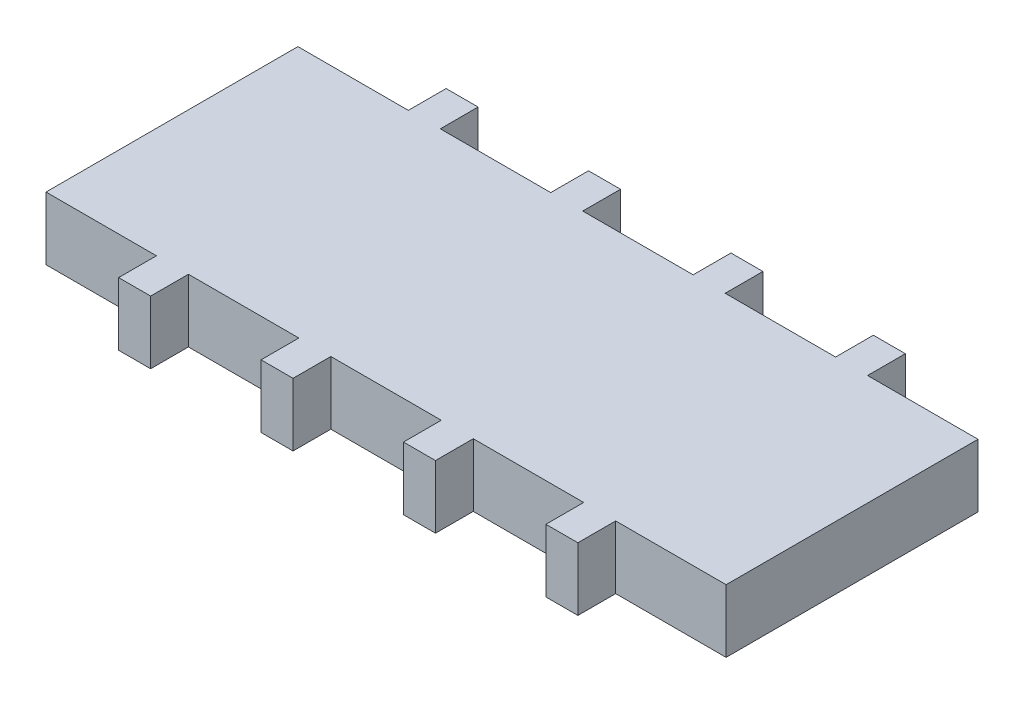
ISO-10303-21;
HEADER;
FILE_DESCRIPTION(('STEP AP214'),'2;1');
FILE_NAME('part.step','',(''),(''),'','','');
FILE_SCHEMA(('AUTOMOTIVE_DESIGN { 1 0 10303 214 1 1 1 1 }'));
ENDSEC;
DATA;
#1=APPLICATION_CONTEXT('core data for automotive mechanical design processes');
#2=APPLICATION_PROTOCOL_DEFINITION('international standard','automotive_design',2000,#1);
#3=PRODUCT_CONTEXT('',#1,'mechanical');
#4=PRODUCT('Part','Part','',(#3));
#5=PRODUCT_RELATED_PRODUCT_CATEGORY('part','',(#4));
#6=PRODUCT_DEFINITION_FORMATION('','',#4);
#7=PRODUCT_DEFINITION_CONTEXT('part definition',#1,'design');
#8=PRODUCT_DEFINITION('design','',#6,#7);
#9=PRODUCT_DEFINITION_SHAPE('','',#8);
#10=(LENGTH_UNIT() NAMED_UNIT(*) SI_UNIT(.MILLI.,.METRE.));
#11=(NAMED_UNIT(*) PLANE_ANGLE_UNIT() SI_UNIT($,.RADIAN.));
#12=(NAMED_UNIT(*) SI_UNIT($,.STERADIAN.) SOLID_ANGLE_UNIT());
#13=UNCERTAINTY_MEASURE_WITH_UNIT(LENGTH_MEASURE(1.E-05),#10,'distance_accuracy_value','');
#14=(GEOMETRIC_REPRESENTATION_CONTEXT(3) GLOBAL_UNCERTAINTY_ASSIGNED_CONTEXT((#13)) GLOBAL_UNIT_ASSIGNED_CONTEXT((#10,
#11,#12)) REPRESENTATION_CONTEXT('',''));
#15=CARTESIAN_POINT('',(0.,0.,0.));
#16=DIRECTION('',(0.,0.,1.));
#17=DIRECTION('',(1.,0.,0.));
#18=AXIS2_PLACEMENT_3D('',#15,#16,#17);
#19=CARTESIAN_POINT('',(27.,5.,0.));
#20=DIRECTION('',(1.,0.,0.));
#21=DIRECTION('',(0.,0.,-1.));
#22=AXIS2_PLACEMENT_3D('',#19,#20,#21);
#23=PLANE('',#22);
#24=DIRECTION('',(0.,0.,1.));
#25=VECTOR('',#24,1.);
#26=CARTESIAN_POINT('',(27.,0.,0.));
#27=LINE('',#26,#25);
#28=CARTESIAN_POINT('',(27.,0.,-10.));
#29=VERTEX_POINT('',#28);
#30=CARTESIAN_POINT('',(27.,0.,10.));
#31=VERTEX_POINT('',#30);
#32=EDGE_CURVE('E309',#29,#31,#27,.T.);
#33=ORIENTED_EDGE('',*,*,#32,.F.);
#34=DIRECTION('',(0.,-1.,0.));
#35=VECTOR('',#34,1.);
#36=CARTESIAN_POINT('',(27.,5.,-10.));
#37=LINE('',#36,#35);
#38=CARTESIAN_POINT('',(27.,5.,-10.));
#39=VERTEX_POINT('',#38);
#40=EDGE_CURVE('E11',#39,#29,#37,.T.);
#41=ORIENTED_EDGE('',*,*,#40,.F.);
#42=DIRECTION('',(0.,0.,1.));
#43=VECTOR('',#42,1.);
#44=CARTESIAN_POINT('',(27.,5.,0.));
#45=LINE('',#44,#43);
#46=CARTESIAN_POINT('',(27.,5.,10.));
#47=VERTEX_POINT('',#46);
#48=EDGE_CURVE('E540',#39,#47,#45,.T.);
#49=ORIENTED_EDGE('',*,*,#48,.T.);
#50=DIRECTION('',(0.,-1.,0.));
#51=VECTOR('',#50,1.);
#52=CARTESIAN_POINT('',(27.,5.,10.));
#53=LINE('',#52,#51);
#54=EDGE_CURVE('E176',#47,#31,#53,.T.);
#55=ORIENTED_EDGE('',*,*,#54,.T.);
#56=EDGE_LOOP('',(#33,#41,#49,#55));
#57=FACE_BOUND('',#56,.T.);
#58=ADVANCED_FACE('F41',(#57),#23,.T.);
#59=CARTESIAN_POINT('',(0.,5.,-10.));
#60=DIRECTION('',(0.,0.,-1.));
#61=DIRECTION('',(-1.,0.,0.));
#62=AXIS2_PLACEMENT_3D('',#59,#60,#61);
#63=PLANE('',#62);
#64=DIRECTION('',(1.,0.,0.));
#65=VECTOR('',#64,1.);
#66=CARTESIAN_POINT('',(0.,0.,-10.));
#67=LINE('',#66,#65);
#68=CARTESIAN_POINT('',(18.232,0.,-10.));
#69=VERTEX_POINT('',#68);
#70=EDGE_CURVE('E313',#69,#29,#67,.T.);
#71=ORIENTED_EDGE('',*,*,#70,.F.);
#72=DIRECTION('',(0.,-1.,0.));
#73=VECTOR('',#72,1.);
#74=CARTESIAN_POINT('',(18.232,5.,-10.));
#75=LINE('',#74,#73);
#76=CARTESIAN_POINT('',(18.232,5.,-10.));
#77=VERTEX_POINT('',#76);
#78=EDGE_CURVE('E50',#77,#69,#75,.T.);
#79=ORIENTED_EDGE('',*,*,#78,.F.);
#80=DIRECTION('',(1.,0.,0.));
#81=VECTOR('',#80,1.);
#82=CARTESIAN_POINT('',(0.,5.,-10.));
#83=LINE('',#82,#81);
#84=EDGE_CURVE('E538',#77,#39,#83,.T.);
#85=ORIENTED_EDGE('',*,*,#84,.T.);
#86=ORIENTED_EDGE('',*,*,#40,.T.);
#87=EDGE_LOOP('',(#71,#79,#85,#86));
#88=FACE_BOUND('',#87,.T.);
#89=ADVANCED_FACE('F537',(#88),#63,.T.);
#90=CARTESIAN_POINT('',(18.232,5.,0.));
#91=DIRECTION('',(-1.,0.,0.));
#92=DIRECTION('',(0.,0.,1.));
#93=AXIS2_PLACEMENT_3D('',#90,#91,#92);
#94=PLANE('',#93);
#95=DIRECTION('',(0.,0.,-1.));
#96=VECTOR('',#95,1.);
#97=CARTESIAN_POINT('',(18.232,0.,0.));
#98=LINE('',#97,#96);
#99=CARTESIAN_POINT('',(18.232,0.,-13.));
#100=VERTEX_POINT('',#99);
#101=EDGE_CURVE('E317',#69,#100,#98,.T.);
#102=ORIENTED_EDGE('',*,*,#101,.T.);
#103=DIRECTION('',(0.,-1.,0.));
#104=VECTOR('',#103,1.);
#105=CARTESIAN_POINT('',(18.232,5.,-13.));
#106=LINE('',#105,#104);
#107=CARTESIAN_POINT('',(18.232,5.,-13.));
#108=VERTEX_POINT('',#107);
#109=EDGE_CURVE('E521',#108,#100,#106,.T.);
#110=ORIENTED_EDGE('',*,*,#109,.F.);
#111=DIRECTION('',(0.,0.,-1.));
#112=VECTOR('',#111,1.);
#113=CARTESIAN_POINT('',(18.232,5.,0.));
#114=LINE('',#113,#112);
#115=EDGE_CURVE('E529',#77,#108,#114,.T.);
#116=ORIENTED_EDGE('',*,*,#115,.F.);
#117=ORIENTED_EDGE('',*,*,#78,.T.);
#118=EDGE_LOOP('',(#102,#110,#116,#117));
#119=FACE_BOUND('',#118,.T.);
#120=ADVANCED_FACE('F527',(#119),#94,.F.);
#121=CARTESIAN_POINT('',(0.,5.,-13.));
#122=DIRECTION('',(0.,0.,-1.));
#123=DIRECTION('',(-1.,0.,0.));
#124=AXIS2_PLACEMENT_3D('',#121,#122,#123);
#125=PLANE('',#124);
#126=DIRECTION('',(1.,0.,0.));
#127=VECTOR('',#126,1.);
#128=CARTESIAN_POINT('',(0.,0.,-13.));
#129=LINE('',#128,#127);
#130=CARTESIAN_POINT('',(15.692,0.,-13.));
#131=VERTEX_POINT('',#130);
#132=EDGE_CURVE('E323',#131,#100,#129,.T.);
#133=ORIENTED_EDGE('',*,*,#132,.F.);
#134=DIRECTION('',(0.,-1.,0.));
#135=VECTOR('',#134,1.);
#136=CARTESIAN_POINT('',(15.692,5.,-13.));
#137=LINE('',#136,#135);
#138=CARTESIAN_POINT('',(15.692,5.,-13.));
#139=VERTEX_POINT('',#138);
#140=EDGE_CURVE('E518',#139,#131,#137,.T.);
#141=ORIENTED_EDGE('',*,*,#140,.F.);
#142=DIRECTION('',(1.,0.,0.));
#143=VECTOR('',#142,1.);
#144=CARTESIAN_POINT('',(0.,5.,-13.));
#145=LINE('',#144,#143);
#146=EDGE_CURVE('E661',#139,#108,#145,.T.);
#147=ORIENTED_EDGE('',*,*,#146,.T.);
#148=ORIENTED_EDGE('',*,*,#109,.T.);
#149=EDGE_LOOP('',(#133,#141,#147,#148));
#150=FACE_BOUND('',#149,.T.);
#151=ADVANCED_FACE('F730',(#150),#125,.T.);
#152=CARTESIAN_POINT('',(15.692,5.,0.));
#153=DIRECTION('',(-1.,0.,0.));
#154=DIRECTION('',(0.,0.,1.));
#155=AXIS2_PLACEMENT_3D('',#152,#153,#154);
#156=PLANE('',#155);
#157=DIRECTION('',(0.,0.,-1.));
#158=VECTOR('',#157,1.);
#159=CARTESIAN_POINT('',(15.692,0.,0.));
#160=LINE('',#159,#158);
#161=CARTESIAN_POINT('',(15.692,0.,-10.));
#162=VERTEX_POINT('',#161);
#163=EDGE_CURVE('E327',#162,#131,#160,.T.);
#164=ORIENTED_EDGE('',*,*,#163,.F.);
#165=DIRECTION('',(0.,-1.,0.));
#166=VECTOR('',#165,1.);
#167=CARTESIAN_POINT('',(15.692,5.,-10.));
#168=LINE('',#167,#166);
#169=CARTESIAN_POINT('',(15.692,5.,-10.));
#170=VERTEX_POINT('',#169);
#171=EDGE_CURVE('E515',#170,#162,#168,.T.);
#172=ORIENTED_EDGE('',*,*,#171,.F.);
#173=DIRECTION('',(0.,0.,-1.));
#174=VECTOR('',#173,1.);
#175=CARTESIAN_POINT('',(15.692,5.,0.));
#176=LINE('',#175,#174);
#177=EDGE_CURVE('E657',#170,#139,#176,.T.);
#178=ORIENTED_EDGE('',*,*,#177,.T.);
#179=ORIENTED_EDGE('',*,*,#140,.T.);
#180=EDGE_LOOP('',(#164,#172,#178,#179));
#181=FACE_BOUND('',#180,.T.);
#182=ADVANCED_FACE('F735',(#181),#156,.T.);
#183=CARTESIAN_POINT('',(6.924,0.,-10.));
#184=VERTEX_POINT('',#183);
#185=EDGE_CURVE('E319',#184,#162,#67,.T.);
#186=ORIENTED_EDGE('',*,*,#185,.F.);
#187=DIRECTION('',(0.,-1.,0.));
#188=VECTOR('',#187,1.);
#189=CARTESIAN_POINT('',(6.924,5.,-10.));
#190=LINE('',#189,#188);
#191=CARTESIAN_POINT('',(6.924,5.,-10.));
#192=VERTEX_POINT('',#191);
#193=EDGE_CURVE('E512',#192,#184,#190,.T.);
#194=ORIENTED_EDGE('',*,*,#193,.F.);
#195=EDGE_CURVE('E656',#192,#170,#83,.T.);
#196=ORIENTED_EDGE('',*,*,#195,.T.);
#197=ORIENTED_EDGE('',*,*,#171,.T.);
#198=EDGE_LOOP('',(#186,#194,#196,#197));
#199=FACE_BOUND('',#198,.T.);
#200=ADVANCED_FACE('F726',(#199),#63,.T.);
#201=CARTESIAN_POINT('',(6.924,5.,0.));
#202=DIRECTION('',(-1.,0.,0.));
#203=DIRECTION('',(0.,0.,1.));
#204=AXIS2_PLACEMENT_3D('',#201,#202,#203);
#205=PLANE('',#204);
#206=DIRECTION('',(0.,0.,-1.));
#207=VECTOR('',#206,1.);
#208=CARTESIAN_POINT('',(6.924,0.,0.));
#209=LINE('',#208,#207);
#210=CARTESIAN_POINT('',(6.924,0.,-13.));
#211=VERTEX_POINT('',#210);
#212=EDGE_CURVE('E331',#184,#211,#209,.T.);
#213=ORIENTED_EDGE('',*,*,#212,.T.);
#214=DIRECTION('',(0.,-1.,0.));
#215=VECTOR('',#214,1.);
#216=CARTESIAN_POINT('',(6.924,5.,-13.));
#217=LINE('',#216,#215);
#218=CARTESIAN_POINT('',(6.924,5.,-13.));
#219=VERTEX_POINT('',#218);
#220=EDGE_CURVE('E509',#219,#211,#217,.T.);
#221=ORIENTED_EDGE('',*,*,#220,.F.);
#222=DIRECTION('',(0.,0.,-1.));
#223=VECTOR('',#222,1.);
#224=CARTESIAN_POINT('',(6.924,5.,0.));
#225=LINE('',#224,#223);
#226=EDGE_CURVE('E653',#192,#219,#225,.T.);
#227=ORIENTED_EDGE('',*,*,#226,.F.);
#228=ORIENTED_EDGE('',*,*,#193,.T.);
#229=EDGE_LOOP('',(#213,#221,#227,#228));
#230=FACE_BOUND('',#229,.T.);
#231=ADVANCED_FACE('F734',(#230),#205,.F.);
#232=CARTESIAN_POINT('',(0.,5.,-13.));
#233=DIRECTION('',(0.,0.,-1.));
#234=DIRECTION('',(-1.,0.,0.));
#235=AXIS2_PLACEMENT_3D('',#232,#233,#234);
#236=PLANE('',#235);
#237=DIRECTION('',(1.,0.,0.));
#238=VECTOR('',#237,1.);
#239=CARTESIAN_POINT('',(0.,0.,-13.));
#240=LINE('',#239,#238);
#241=CARTESIAN_POINT('',(4.384,0.,-13.));
#242=VERTEX_POINT('',#241);
#243=EDGE_CURVE('E335',#242,#211,#240,.T.);
#244=ORIENTED_EDGE('',*,*,#243,.F.);
#245=DIRECTION('',(0.,-1.,0.));
#246=VECTOR('',#245,1.);
#247=CARTESIAN_POINT('',(4.384,5.,-13.));
#248=LINE('',#247,#246);
#249=CARTESIAN_POINT('',(4.384,5.,-13.));
#250=VERTEX_POINT('',#249);
#251=EDGE_CURVE('E506',#250,#242,#248,.T.);
#252=ORIENTED_EDGE('',*,*,#251,.F.);
#253=DIRECTION('',(1.,0.,0.));
#254=VECTOR('',#253,1.);
#255=CARTESIAN_POINT('',(0.,5.,-13.));
#256=LINE('',#255,#254);
#257=EDGE_CURVE('E649',#250,#219,#256,.T.);
#258=ORIENTED_EDGE('',*,*,#257,.T.);
#259=ORIENTED_EDGE('',*,*,#220,.T.);
#260=EDGE_LOOP('',(#244,#252,#258,#259));
#261=FACE_BOUND('',#260,.T.);
#262=ADVANCED_FACE('F807',(#261),#236,.T.);
#263=CARTESIAN_POINT('',(4.384,5.,0.));
#264=DIRECTION('',(-1.,0.,0.));
#265=DIRECTION('',(0.,0.,1.));
#266=AXIS2_PLACEMENT_3D('',#263,#264,#265);
#267=PLANE('',#266);
#268=DIRECTION('',(0.,0.,-1.));
#269=VECTOR('',#268,1.);
#270=CARTESIAN_POINT('',(4.384,0.,0.));
#271=LINE('',#270,#269);
#272=CARTESIAN_POINT('',(4.384,0.,-10.));
#273=VERTEX_POINT('',#272);
#274=EDGE_CURVE('E339',#273,#242,#271,.T.);
#275=ORIENTED_EDGE('',*,*,#274,.F.);
#276=DIRECTION('',(0.,-1.,0.));
#277=VECTOR('',#276,1.);
#278=CARTESIAN_POINT('',(4.384,5.,-10.));
#279=LINE('',#278,#277);
#280=CARTESIAN_POINT('',(4.384,5.,-10.));
#281=VERTEX_POINT('',#280);
#282=EDGE_CURVE('E503',#281,#273,#279,.T.);
#283=ORIENTED_EDGE('',*,*,#282,.F.);
#284=DIRECTION('',(0.,0.,-1.));
#285=VECTOR('',#284,1.);
#286=CARTESIAN_POINT('',(4.384,5.,0.));
#287=LINE('',#286,#285);
#288=EDGE_CURVE('E645',#281,#250,#287,.T.);
#289=ORIENTED_EDGE('',*,*,#288,.T.);
#290=ORIENTED_EDGE('',*,*,#251,.T.);
#291=EDGE_LOOP('',(#275,#283,#289,#290));
#292=FACE_BOUND('',#291,.T.);
#293=ADVANCED_FACE('F798',(#292),#267,.T.);
#294=CARTESIAN_POINT('',(-4.384,0.,-10.));
#295=VERTEX_POINT('',#294);
#296=EDGE_CURVE('E343',#295,#273,#67,.T.);
#297=ORIENTED_EDGE('',*,*,#296,.F.);
#298=DIRECTION('',(0.,-1.,0.));
#299=VECTOR('',#298,1.);
#300=CARTESIAN_POINT('',(-4.384,5.,-10.));
#301=LINE('',#300,#299);
#302=CARTESIAN_POINT('',(-4.384,5.,-10.));
#303=VERTEX_POINT('',#302);
#304=EDGE_CURVE('E500',#303,#295,#301,.T.);
#305=ORIENTED_EDGE('',*,*,#304,.F.);
#306=EDGE_CURVE('E644',#303,#281,#83,.T.);
#307=ORIENTED_EDGE('',*,*,#306,.T.);
#308=ORIENTED_EDGE('',*,*,#282,.T.);
#309=EDGE_LOOP('',(#297,#305,#307,#308));
#310=FACE_BOUND('',#309,.T.);
#311=ADVANCED_FACE('F720',(#310),#63,.T.);
#312=CARTESIAN_POINT('',(-4.384,5.,0.));
#313=DIRECTION('',(-1.,0.,0.));
#314=DIRECTION('',(0.,0.,1.));
#315=AXIS2_PLACEMENT_3D('',#312,#313,#314);
#316=PLANE('',#315);
#317=DIRECTION('',(0.,0.,-1.));
#318=VECTOR('',#317,1.);
#319=CARTESIAN_POINT('',(-4.384,0.,0.));
#320=LINE('',#319,#318);
#321=CARTESIAN_POINT('',(-4.384,0.,-13.));
#322=VERTEX_POINT('',#321);
#323=EDGE_CURVE('E344',#295,#322,#320,.T.);
#324=ORIENTED_EDGE('',*,*,#323,.T.);
#325=DIRECTION('',(0.,-1.,0.));
#326=VECTOR('',#325,1.);
#327=CARTESIAN_POINT('',(-4.384,5.,-13.));
#328=LINE('',#327,#326);
#329=CARTESIAN_POINT('',(-4.384,5.,-13.));
#330=VERTEX_POINT('',#329);
#331=EDGE_CURVE('E496',#330,#322,#328,.T.);
#332=ORIENTED_EDGE('',*,*,#331,.F.);
#333=DIRECTION('',(0.,0.,-1.));
#334=VECTOR('',#333,1.);
#335=CARTESIAN_POINT('',(-4.384,5.,0.));
#336=LINE('',#335,#334);
#337=EDGE_CURVE('E641',#303,#330,#336,.T.);
#338=ORIENTED_EDGE('',*,*,#337,.F.);
#339=ORIENTED_EDGE('',*,*,#304,.T.);
#340=EDGE_LOOP('',(#324,#332,#338,#339));
#341=FACE_BOUND('',#340,.T.);
#342=ADVANCED_FACE('F779',(#341),#316,.F.);
#343=CARTESIAN_POINT('',(0.,5.,-13.));
#344=DIRECTION('',(0.,0.,1.));
#345=DIRECTION('',(1.,0.,0.));
#346=AXIS2_PLACEMENT_3D('',#343,#344,#345);
#347=PLANE('',#346);
#348=DIRECTION('',(-1.,0.,0.));
#349=VECTOR('',#348,1.);
#350=CARTESIAN_POINT('',(0.,0.,-13.));
#351=LINE('',#350,#349);
#352=CARTESIAN_POINT('',(-6.924,0.,-13.));
#353=VERTEX_POINT('',#352);
#354=EDGE_CURVE('E347',#322,#353,#351,.T.);
#355=ORIENTED_EDGE('',*,*,#354,.T.);
#356=DIRECTION('',(0.,-1.,0.));
#357=VECTOR('',#356,1.);
#358=CARTESIAN_POINT('',(-6.924,5.,-13.));
#359=LINE('',#358,#357);
#360=CARTESIAN_POINT('',(-6.924,5.,-13.));
#361=VERTEX_POINT('',#360);
#362=EDGE_CURVE('E493',#361,#353,#359,.T.);
#363=ORIENTED_EDGE('',*,*,#362,.F.);
#364=DIRECTION('',(-1.,0.,0.));
#365=VECTOR('',#364,1.);
#366=CARTESIAN_POINT('',(0.,5.,-13.));
#367=LINE('',#366,#365);
#368=EDGE_CURVE('E638',#330,#361,#367,.T.);
#369=ORIENTED_EDGE('',*,*,#368,.F.);
#370=ORIENTED_EDGE('',*,*,#331,.T.);
#371=EDGE_LOOP('',(#355,#363,#369,#370));
#372=FACE_BOUND('',#371,.T.);
#373=ADVANCED_FACE('F770',(#372),#347,.F.);
#374=CARTESIAN_POINT('',(-6.924,5.,0.));
#375=DIRECTION('',(-1.,0.,0.));
#376=DIRECTION('',(0.,0.,1.));
#377=AXIS2_PLACEMENT_3D('',#374,#375,#376);
#378=PLANE('',#377);
#379=DIRECTION('',(0.,0.,-1.));
#380=VECTOR('',#379,1.);
#381=CARTESIAN_POINT('',(-6.924,0.,0.));
#382=LINE('',#381,#380);
#383=CARTESIAN_POINT('',(-6.924,0.,-10.));
#384=VERTEX_POINT('',#383);
#385=EDGE_CURVE('E351',#384,#353,#382,.T.);
#386=ORIENTED_EDGE('',*,*,#385,.F.);
#387=DIRECTION('',(0.,-1.,0.));
#388=VECTOR('',#387,1.);
#389=CARTESIAN_POINT('',(-6.924,5.,-10.));
#390=LINE('',#389,#388);
#391=CARTESIAN_POINT('',(-6.924,5.,-10.));
#392=VERTEX_POINT('',#391);
#393=EDGE_CURVE('E490',#392,#384,#390,.T.);
#394=ORIENTED_EDGE('',*,*,#393,.F.);
#395=DIRECTION('',(0.,0.,-1.));
#396=VECTOR('',#395,1.);
#397=CARTESIAN_POINT('',(-6.924,5.,0.));
#398=LINE('',#397,#396);
#399=EDGE_CURVE('E634',#392,#361,#398,.T.);
#400=ORIENTED_EDGE('',*,*,#399,.T.);
#401=ORIENTED_EDGE('',*,*,#362,.T.);
#402=EDGE_LOOP('',(#386,#394,#400,#401));
#403=FACE_BOUND('',#402,.T.);
#404=ADVANCED_FACE('F689',(#403),#378,.T.);
#405=CARTESIAN_POINT('',(-15.692,0.,-10.));
#406=VERTEX_POINT('',#405);
#407=EDGE_CURVE('E355',#406,#384,#67,.T.);
#408=ORIENTED_EDGE('',*,*,#407,.F.);
#409=DIRECTION('',(0.,-1.,0.));
#410=VECTOR('',#409,1.);
#411=CARTESIAN_POINT('',(-15.692,5.,-10.));
#412=LINE('',#411,#410);
#413=CARTESIAN_POINT('',(-15.692,5.,-10.));
#414=VERTEX_POINT('',#413);
#415=EDGE_CURVE('E487',#414,#406,#412,.T.);
#416=ORIENTED_EDGE('',*,*,#415,.F.);
#417=EDGE_CURVE('E622',#414,#392,#83,.T.);
#418=ORIENTED_EDGE('',*,*,#417,.T.);
#419=ORIENTED_EDGE('',*,*,#393,.T.);
#420=EDGE_LOOP('',(#408,#416,#418,#419));
#421=FACE_BOUND('',#420,.T.);
#422=ADVANCED_FACE('F680',(#421),#63,.T.);
#423=CARTESIAN_POINT('',(-15.692,5.,0.));
#424=DIRECTION('',(-1.,0.,0.));
#425=DIRECTION('',(0.,0.,1.));
#426=AXIS2_PLACEMENT_3D('',#423,#424,#425);
#427=PLANE('',#426);
#428=DIRECTION('',(0.,0.,-1.));
#429=VECTOR('',#428,1.);
#430=CARTESIAN_POINT('',(-15.692,0.,0.));
#431=LINE('',#430,#429);
#432=CARTESIAN_POINT('',(-15.692,0.,-13.));
#433=VERTEX_POINT('',#432);
#434=EDGE_CURVE('E356',#406,#433,#431,.T.);
#435=ORIENTED_EDGE('',*,*,#434,.T.);
#436=DIRECTION('',(0.,-1.,0.));
#437=VECTOR('',#436,1.);
#438=CARTESIAN_POINT('',(-15.692,5.,-13.));
#439=LINE('',#438,#437);
#440=CARTESIAN_POINT('',(-15.692,5.,-13.));
#441=VERTEX_POINT('',#440);
#442=EDGE_CURVE('E484',#441,#433,#439,.T.);
#443=ORIENTED_EDGE('',*,*,#442,.F.);
#444=DIRECTION('',(0.,0.,-1.));
#445=VECTOR('',#444,1.);
#446=CARTESIAN_POINT('',(-15.692,5.,0.));
#447=LINE('',#446,#445);
#448=EDGE_CURVE('E631',#414,#441,#447,.T.);
#449=ORIENTED_EDGE('',*,*,#448,.F.);
#450=ORIENTED_EDGE('',*,*,#415,.T.);
#451=EDGE_LOOP('',(#435,#443,#449,#450));
#452=FACE_BOUND('',#451,.T.);
#453=ADVANCED_FACE('F711',(#452),#427,.F.);
#454=CARTESIAN_POINT('',(0.,5.,-13.));
#455=DIRECTION('',(0.,0.,-1.));
#456=DIRECTION('',(-1.,0.,0.));
#457=AXIS2_PLACEMENT_3D('',#454,#455,#456);
#458=PLANE('',#457);
#459=DIRECTION('',(1.,0.,0.));
#460=VECTOR('',#459,1.);
#461=CARTESIAN_POINT('',(0.,0.,-13.));
#462=LINE('',#461,#460);
#463=CARTESIAN_POINT('',(-18.232,0.,-13.));
#464=VERTEX_POINT('',#463);
#465=EDGE_CURVE('E360',#464,#433,#462,.T.);
#466=ORIENTED_EDGE('',*,*,#465,.F.);
#467=DIRECTION('',(0.,-1.,0.));
#468=VECTOR('',#467,1.);
#469=CARTESIAN_POINT('',(-18.232,5.,-13.));
#470=LINE('',#469,#468);
#471=CARTESIAN_POINT('',(-18.232,5.,-13.));
#472=VERTEX_POINT('',#471);
#473=EDGE_CURVE('E481',#472,#464,#470,.T.);
#474=ORIENTED_EDGE('',*,*,#473,.F.);
#475=DIRECTION('',(1.,0.,0.));
#476=VECTOR('',#475,1.);
#477=CARTESIAN_POINT('',(0.,5.,-13.));
#478=LINE('',#477,#476);
#479=EDGE_CURVE('E627',#472,#441,#478,.T.);
#480=ORIENTED_EDGE('',*,*,#479,.T.);
#481=ORIENTED_EDGE('',*,*,#442,.T.);
#482=EDGE_LOOP('',(#466,#474,#480,#481));
#483=FACE_BOUND('',#482,.T.);
#484=ADVANCED_FACE('F709',(#483),#458,.T.);
#485=CARTESIAN_POINT('',(-18.232,5.,0.));
#486=DIRECTION('',(-1.,0.,0.));
#487=DIRECTION('',(0.,0.,1.));
#488=AXIS2_PLACEMENT_3D('',#485,#486,#487);
#489=PLANE('',#488);
#490=DIRECTION('',(0.,0.,-1.));
#491=VECTOR('',#490,1.);
#492=CARTESIAN_POINT('',(-18.232,0.,0.));
#493=LINE('',#492,#491);
#494=CARTESIAN_POINT('',(-18.232,0.,-10.));
#495=VERTEX_POINT('',#494);
#496=EDGE_CURVE('E364',#495,#464,#493,.T.);
#497=ORIENTED_EDGE('',*,*,#496,.F.);
#498=DIRECTION('',(0.,-1.,0.));
#499=VECTOR('',#498,1.);
#500=CARTESIAN_POINT('',(-18.232,5.,-10.));
#501=LINE('',#500,#499);
#502=CARTESIAN_POINT('',(-18.232,5.,-10.));
#503=VERTEX_POINT('',#502);
#504=EDGE_CURVE('E478',#503,#495,#501,.T.);
#505=ORIENTED_EDGE('',*,*,#504,.F.);
#506=DIRECTION('',(0.,0.,-1.));
#507=VECTOR('',#506,1.);
#508=CARTESIAN_POINT('',(-18.232,5.,0.));
#509=LINE('',#508,#507);
#510=EDGE_CURVE('E620',#503,#472,#509,.T.);
#511=ORIENTED_EDGE('',*,*,#510,.T.);
#512=ORIENTED_EDGE('',*,*,#473,.T.);
#513=EDGE_LOOP('',(#497,#505,#511,#512));
#514=FACE_BOUND('',#513,.T.);
#515=ADVANCED_FACE('F706',(#514),#489,.T.);
#516=CARTESIAN_POINT('',(-27.,0.,-10.));
#517=VERTEX_POINT('',#516);
#518=EDGE_CURVE('E318',#517,#495,#67,.T.);
#519=ORIENTED_EDGE('',*,*,#518,.F.);
#520=DIRECTION('',(0.,-1.,0.));
#521=VECTOR('',#520,1.);
#522=CARTESIAN_POINT('',(-27.,5.,-10.));
#523=LINE('',#522,#521);
#524=CARTESIAN_POINT('',(-27.,5.,-10.));
#525=VERTEX_POINT('',#524);
#526=EDGE_CURVE('E475',#525,#517,#523,.T.);
#527=ORIENTED_EDGE('',*,*,#526,.F.);
#528=EDGE_CURVE('E614',#525,#503,#83,.T.);
#529=ORIENTED_EDGE('',*,*,#528,.T.);
#530=ORIENTED_EDGE('',*,*,#504,.T.);
#531=EDGE_LOOP('',(#519,#527,#529,#530));
#532=FACE_BOUND('',#531,.T.);
#533=ADVANCED_FACE('F703',(#532),#63,.T.);
#534=CARTESIAN_POINT('',(-27.,5.,0.));
#535=DIRECTION('',(1.,0.,0.));
#536=DIRECTION('',(0.,0.,-1.));
#537=AXIS2_PLACEMENT_3D('',#534,#535,#536);
#538=PLANE('',#537);
#539=DIRECTION('',(0.,0.,1.));
#540=VECTOR('',#539,1.);
#541=CARTESIAN_POINT('',(-27.,0.,0.));
#542=LINE('',#541,#540);
#543=CARTESIAN_POINT('',(-27.,0.,10.));
#544=VERTEX_POINT('',#543);
#545=EDGE_CURVE('E368',#517,#544,#542,.T.);
#546=ORIENTED_EDGE('',*,*,#545,.T.);
#547=DIRECTION('',(0.,-1.,0.));
#548=VECTOR('',#547,1.);
#549=CARTESIAN_POINT('',(-27.,5.,10.));
#550=LINE('',#549,#548);
#551=CARTESIAN_POINT('',(-27.,5.,10.));
#552=VERTEX_POINT('',#551);
#553=EDGE_CURVE('E471',#552,#544,#550,.T.);
#554=ORIENTED_EDGE('',*,*,#553,.F.);
#555=DIRECTION('',(0.,0.,1.));
#556=VECTOR('',#555,1.);
#557=CARTESIAN_POINT('',(-27.,5.,0.));
#558=LINE('',#557,#556);
#559=EDGE_CURVE('E609',#525,#552,#558,.T.);
#560=ORIENTED_EDGE('',*,*,#559,.F.);
#561=ORIENTED_EDGE('',*,*,#526,.T.);
#562=EDGE_LOOP('',(#546,#554,#560,#561));
#563=FACE_BOUND('',#562,.T.);
#564=ADVANCED_FACE('F737',(#563),#538,.F.);
#565=CARTESIAN_POINT('',(0.,5.,10.));
#566=DIRECTION('',(0.,0.,-1.));
#567=DIRECTION('',(-1.,0.,0.));
#568=AXIS2_PLACEMENT_3D('',#565,#566,#567);
#569=PLANE('',#568);
#570=DIRECTION('',(1.,0.,0.));
#571=VECTOR('',#570,1.);
#572=CARTESIAN_POINT('',(0.,0.,10.));
#573=LINE('',#572,#571);
#574=CARTESIAN_POINT('',(-18.232,0.,10.));
#575=VERTEX_POINT('',#574);
#576=EDGE_CURVE('E371',#544,#575,#573,.T.);
#577=ORIENTED_EDGE('',*,*,#576,.T.);
#578=DIRECTION('',(0.,-1.,0.));
#579=VECTOR('',#578,1.);
#580=CARTESIAN_POINT('',(-18.232,5.,10.));
#581=LINE('',#580,#579);
#582=CARTESIAN_POINT('',(-18.232,5.,10.));
#583=VERTEX_POINT('',#582);
#584=EDGE_CURVE('E467',#583,#575,#581,.T.);
#585=ORIENTED_EDGE('',*,*,#584,.F.);
#586=DIRECTION('',(1.,0.,0.));
#587=VECTOR('',#586,1.);
#588=CARTESIAN_POINT('',(0.,5.,10.));
#589=LINE('',#588,#587);
#590=EDGE_CURVE('E306',#552,#583,#589,.T.);
#591=ORIENTED_EDGE('',*,*,#590,.F.);
#592=ORIENTED_EDGE('',*,*,#553,.T.);
#593=EDGE_LOOP('',(#577,#585,#591,#592));
#594=FACE_BOUND('',#593,.T.);
#595=ADVANCED_FACE('F742',(#594),#569,.F.);
#596=CARTESIAN_POINT('',(-18.232,5.,0.));
#597=DIRECTION('',(1.,0.,0.));
#598=DIRECTION('',(0.,0.,-1.));
#599=AXIS2_PLACEMENT_3D('',#596,#597,#598);
#600=PLANE('',#599);
#601=DIRECTION('',(0.,0.,1.));
#602=VECTOR('',#601,1.);
#603=CARTESIAN_POINT('',(-18.232,0.,0.));
#604=LINE('',#603,#602);
#605=CARTESIAN_POINT('',(-18.232,0.,13.));
#606=VERTEX_POINT('',#605);
#607=EDGE_CURVE('E374',#575,#606,#604,.T.);
#608=ORIENTED_EDGE('',*,*,#607,.T.);
#609=DIRECTION('',(0.,-1.,0.));
#610=VECTOR('',#609,1.);
#611=CARTESIAN_POINT('',(-18.232,5.,13.));
#612=LINE('',#611,#610);
#613=CARTESIAN_POINT('',(-18.232,5.,13.));
#614=VERTEX_POINT('',#613);
#615=EDGE_CURVE('E463',#614,#606,#612,.T.);
#616=ORIENTED_EDGE('',*,*,#615,.F.);
#617=DIRECTION('',(0.,0.,1.));
#618=VECTOR('',#617,1.);
#619=CARTESIAN_POINT('',(-18.232,5.,0.));
#620=LINE('',#619,#618);
#621=EDGE_CURVE('E608',#583,#614,#620,.T.);
#622=ORIENTED_EDGE('',*,*,#621,.F.);
#623=ORIENTED_EDGE('',*,*,#584,.T.);
#624=EDGE_LOOP('',(#608,#616,#622,#623));
#625=FACE_BOUND('',#624,.T.);
#626=ADVANCED_FACE('F959',(#625),#600,.F.);
#627=CARTESIAN_POINT('',(0.,5.,13.));
#628=DIRECTION('',(0.,0.,-1.));
#629=DIRECTION('',(-1.,0.,0.));
#630=AXIS2_PLACEMENT_3D('',#627,#628,#629);
#631=PLANE('',#630);
#632=DIRECTION('',(1.,0.,0.));
#633=VECTOR('',#632,1.);
#634=CARTESIAN_POINT('',(0.,0.,13.));
#635=LINE('',#634,#633);
#636=CARTESIAN_POINT('',(-15.692,0.,13.));
#637=VERTEX_POINT('',#636);
#638=EDGE_CURVE('E379',#606,#637,#635,.T.);
#639=ORIENTED_EDGE('',*,*,#638,.T.);
#640=DIRECTION('',(0.,-1.,0.));
#641=VECTOR('',#640,1.);
#642=CARTESIAN_POINT('',(-15.692,5.,13.));
#643=LINE('',#642,#641);
#644=CARTESIAN_POINT('',(-15.692,5.,13.));
#645=VERTEX_POINT('',#644);
#646=EDGE_CURVE('E460',#645,#637,#643,.T.);
#647=ORIENTED_EDGE('',*,*,#646,.F.);
#648=DIRECTION('',(1.,0.,0.));
#649=VECTOR('',#648,1.);
#650=CARTESIAN_POINT('',(0.,5.,13.));
#651=LINE('',#650,#649);
#652=EDGE_CURVE('E606',#614,#645,#651,.T.);
#653=ORIENTED_EDGE('',*,*,#652,.F.);
#654=ORIENTED_EDGE('',*,*,#615,.T.);
#655=EDGE_LOOP('',(#639,#647,#653,#654));
#656=FACE_BOUND('',#655,.T.);
#657=ADVANCED_FACE('F981',(#656),#631,.F.);
#658=CARTESIAN_POINT('',(-15.692,5.,0.));
#659=DIRECTION('',(1.,0.,0.));
#660=DIRECTION('',(0.,0.,-1.));
#661=AXIS2_PLACEMENT_3D('',#658,#659,#660);
#662=PLANE('',#661);
#663=DIRECTION('',(0.,0.,1.));
#664=VECTOR('',#663,1.);
#665=CARTESIAN_POINT('',(-15.692,0.,0.));
#666=LINE('',#665,#664);
#667=CARTESIAN_POINT('',(-15.692,0.,10.));
#668=VERTEX_POINT('',#667);
#669=EDGE_CURVE('E383',#668,#637,#666,.T.);
#670=ORIENTED_EDGE('',*,*,#669,.F.);
#671=DIRECTION('',(0.,-1.,0.));
#672=VECTOR('',#671,1.);
#673=CARTESIAN_POINT('',(-15.692,5.,10.));
#674=LINE('',#673,#672);
#675=CARTESIAN_POINT('',(-15.692,5.,10.));
#676=VERTEX_POINT('',#675);
#677=EDGE_CURVE('E457',#676,#668,#674,.T.);
#678=ORIENTED_EDGE('',*,*,#677,.F.);
#679=DIRECTION('',(0.,0.,1.));
#680=VECTOR('',#679,1.);
#681=CARTESIAN_POINT('',(-15.692,5.,0.));
#682=LINE('',#681,#680);
#683=EDGE_CURVE('E602',#676,#645,#682,.T.);
#684=ORIENTED_EDGE('',*,*,#683,.T.);
#685=ORIENTED_EDGE('',*,*,#646,.T.);
#686=EDGE_LOOP('',(#670,#678,#684,#685));
#687=FACE_BOUND('',#686,.T.);
#688=ADVANCED_FACE('F990',(#687),#662,.T.);
#689=CARTESIAN_POINT('',(-6.924,0.,10.));
#690=VERTEX_POINT('',#689);
#691=EDGE_CURVE('E376',#668,#690,#573,.T.);
#692=ORIENTED_EDGE('',*,*,#691,.T.);
#693=DIRECTION('',(0.,-1.,0.));
#694=VECTOR('',#693,1.);
#695=CARTESIAN_POINT('',(-6.924,5.,10.));
#696=LINE('',#695,#694);
#697=CARTESIAN_POINT('',(-6.924,5.,10.));
#698=VERTEX_POINT('',#697);
#699=EDGE_CURVE('E453',#698,#690,#696,.T.);
#700=ORIENTED_EDGE('',*,*,#699,.F.);
#701=EDGE_CURVE('E580',#676,#698,#589,.T.);
#702=ORIENTED_EDGE('',*,*,#701,.F.);
#703=ORIENTED_EDGE('',*,*,#677,.T.);
#704=EDGE_LOOP('',(#692,#700,#702,#703));
#705=FACE_BOUND('',#704,.T.);
#706=ADVANCED_FACE('F555',(#705),#569,.F.);
#707=CARTESIAN_POINT('',(-6.924,5.,0.));
#708=DIRECTION('',(1.,0.,0.));
#709=DIRECTION('',(0.,0.,-1.));
#710=AXIS2_PLACEMENT_3D('',#707,#708,#709);
#711=PLANE('',#710);
#712=DIRECTION('',(0.,0.,1.));
#713=VECTOR('',#712,1.);
#714=CARTESIAN_POINT('',(-6.924,0.,0.));
#715=LINE('',#714,#713);
#716=CARTESIAN_POINT('',(-6.924,0.,13.));
#717=VERTEX_POINT('',#716);
#718=EDGE_CURVE('E387',#690,#717,#715,.T.);
#719=ORIENTED_EDGE('',*,*,#718,.T.);
#720=DIRECTION('',(0.,-1.,0.));
#721=VECTOR('',#720,1.);
#722=CARTESIAN_POINT('',(-6.924,5.,13.));
#723=LINE('',#722,#721);
#724=CARTESIAN_POINT('',(-6.924,5.,13.));
#725=VERTEX_POINT('',#724);
#726=EDGE_CURVE('E449',#725,#717,#723,.T.);
#727=ORIENTED_EDGE('',*,*,#726,.F.);
#728=DIRECTION('',(0.,0.,1.));
#729=VECTOR('',#728,1.);
#730=CARTESIAN_POINT('',(-6.924,5.,0.));
#731=LINE('',#730,#729);
#732=EDGE_CURVE('E563',#698,#725,#731,.T.);
#733=ORIENTED_EDGE('',*,*,#732,.F.);
#734=ORIENTED_EDGE('',*,*,#699,.T.);
#735=EDGE_LOOP('',(#719,#727,#733,#734));
#736=FACE_BOUND('',#735,.T.);
#737=ADVANCED_FACE('F561',(#736),#711,.F.);
#738=CARTESIAN_POINT('',(0.,5.,13.));
#739=DIRECTION('',(0.,0.,-1.));
#740=DIRECTION('',(-1.,0.,0.));
#741=AXIS2_PLACEMENT_3D('',#738,#739,#740);
#742=PLANE('',#741);
#743=DIRECTION('',(1.,0.,0.));
#744=VECTOR('',#743,1.);
#745=CARTESIAN_POINT('',(0.,0.,13.));
#746=LINE('',#745,#744);
#747=CARTESIAN_POINT('',(-4.384,0.,13.));
#748=VERTEX_POINT('',#747);
#749=EDGE_CURVE('E390',#717,#748,#746,.T.);
#750=ORIENTED_EDGE('',*,*,#749,.T.);
#751=DIRECTION('',(0.,-1.,0.));
#752=VECTOR('',#751,1.);
#753=CARTESIAN_POINT('',(-4.384,5.,13.));
#754=LINE('',#753,#752);
#755=CARTESIAN_POINT('',(-4.384,5.,13.));
#756=VERTEX_POINT('',#755);
#757=EDGE_CURVE('E446',#756,#748,#754,.T.);
#758=ORIENTED_EDGE('',*,*,#757,.F.);
#759=DIRECTION('',(1.,0.,0.));
#760=VECTOR('',#759,1.);
#761=CARTESIAN_POINT('',(0.,5.,13.));
#762=LINE('',#761,#760);
#763=EDGE_CURVE('E571',#725,#756,#762,.T.);
#764=ORIENTED_EDGE('',*,*,#763,.F.);
#765=ORIENTED_EDGE('',*,*,#726,.T.);
#766=EDGE_LOOP('',(#750,#758,#764,#765));
#767=FACE_BOUND('',#766,.T.);
#768=ADVANCED_FACE('F568',(#767),#742,.F.);
#769=CARTESIAN_POINT('',(-4.384,5.,0.));
#770=DIRECTION('',(1.,0.,0.));
#771=DIRECTION('',(0.,0.,-1.));
#772=AXIS2_PLACEMENT_3D('',#769,#770,#771);
#773=PLANE('',#772);
#774=DIRECTION('',(0.,0.,1.));
#775=VECTOR('',#774,1.);
#776=CARTESIAN_POINT('',(-4.384,0.,0.));
#777=LINE('',#776,#775);
#778=CARTESIAN_POINT('',(-4.384,0.,10.));
#779=VERTEX_POINT('',#778);
#780=EDGE_CURVE('E394',#779,#748,#777,.T.);
#781=ORIENTED_EDGE('',*,*,#780,.F.);
#782=DIRECTION('',(0.,-1.,0.));
#783=VECTOR('',#782,1.);
#784=CARTESIAN_POINT('',(-4.384,5.,10.));
#785=LINE('',#784,#783);
#786=CARTESIAN_POINT('',(-4.384,5.,10.));
#787=VERTEX_POINT('',#786);
#788=EDGE_CURVE('E443',#787,#779,#785,.T.);
#789=ORIENTED_EDGE('',*,*,#788,.F.);
#790=DIRECTION('',(0.,0.,1.));
#791=VECTOR('',#790,1.);
#792=CARTESIAN_POINT('',(-4.384,5.,0.));
#793=LINE('',#792,#791);
#794=EDGE_CURVE('E574',#787,#756,#793,.T.);
#795=ORIENTED_EDGE('',*,*,#794,.T.);
#796=ORIENTED_EDGE('',*,*,#757,.T.);
#797=EDGE_LOOP('',(#781,#789,#795,#796));
#798=FACE_BOUND('',#797,.T.);
#799=ADVANCED_FACE('F1033',(#798),#773,.T.);
#800=CARTESIAN_POINT('',(4.384,0.,10.));
#801=VERTEX_POINT('',#800);
#802=EDGE_CURVE('E398',#779,#801,#573,.T.);
#803=ORIENTED_EDGE('',*,*,#802,.T.);
#804=DIRECTION('',(0.,-1.,0.));
#805=VECTOR('',#804,1.);
#806=CARTESIAN_POINT('',(4.384,5.,10.));
#807=LINE('',#806,#805);
#808=CARTESIAN_POINT('',(4.384,5.,10.));
#809=VERTEX_POINT('',#808);
#810=EDGE_CURVE('E439',#809,#801,#807,.T.);
#811=ORIENTED_EDGE('',*,*,#810,.F.);
#812=EDGE_CURVE('E578',#787,#809,#589,.T.);
#813=ORIENTED_EDGE('',*,*,#812,.F.);
#814=ORIENTED_EDGE('',*,*,#788,.T.);
#815=EDGE_LOOP('',(#803,#811,#813,#814));
#816=FACE_BOUND('',#815,.T.);
#817=ADVANCED_FACE('F1007',(#816),#569,.F.);
#818=CARTESIAN_POINT('',(4.384,5.,0.));
#819=DIRECTION('',(1.,0.,0.));
#820=DIRECTION('',(0.,0.,-1.));
#821=AXIS2_PLACEMENT_3D('',#818,#819,#820);
#822=PLANE('',#821);
#823=DIRECTION('',(0.,0.,1.));
#824=VECTOR('',#823,1.);
#825=CARTESIAN_POINT('',(4.384,0.,0.));
#826=LINE('',#825,#824);
#827=CARTESIAN_POINT('',(4.384,0.,13.));
#828=VERTEX_POINT('',#827);
#829=EDGE_CURVE('E399',#801,#828,#826,.T.);
#830=ORIENTED_EDGE('',*,*,#829,.T.);
#831=DIRECTION('',(0.,-1.,0.));
#832=VECTOR('',#831,1.);
#833=CARTESIAN_POINT('',(4.384,5.,13.));
#834=LINE('',#833,#832);
#835=CARTESIAN_POINT('',(4.384,5.,13.));
#836=VERTEX_POINT('',#835);
#837=EDGE_CURVE('E435',#836,#828,#834,.T.);
#838=ORIENTED_EDGE('',*,*,#837,.F.);
#839=DIRECTION('',(0.,0.,1.));
#840=VECTOR('',#839,1.);
#841=CARTESIAN_POINT('',(4.384,5.,0.));
#842=LINE('',#841,#840);
#843=EDGE_CURVE('E584',#809,#836,#842,.T.);
#844=ORIENTED_EDGE('',*,*,#843,.F.);
#845=ORIENTED_EDGE('',*,*,#810,.T.);
#846=EDGE_LOOP('',(#830,#838,#844,#845));
#847=FACE_BOUND('',#846,.T.);
#848=ADVANCED_FACE('F1049',(#847),#822,.F.);
#849=CARTESIAN_POINT('',(0.,5.,13.));
#850=DIRECTION('',(0.,0.,-1.));
#851=DIRECTION('',(-1.,0.,0.));
#852=AXIS2_PLACEMENT_3D('',#849,#850,#851);
#853=PLANE('',#852);
#854=DIRECTION('',(1.,0.,0.));
#855=VECTOR('',#854,1.);
#856=CARTESIAN_POINT('',(0.,0.,13.));
#857=LINE('',#856,#855);
#858=CARTESIAN_POINT('',(6.924,0.,13.));
#859=VERTEX_POINT('',#858);
#860=EDGE_CURVE('E402',#828,#859,#857,.T.);
#861=ORIENTED_EDGE('',*,*,#860,.T.);
#862=DIRECTION('',(0.,-1.,0.));
#863=VECTOR('',#862,1.);
#864=CARTESIAN_POINT('',(6.924,5.,13.));
#865=LINE('',#864,#863);
#866=CARTESIAN_POINT('',(6.924,5.,13.));
#867=VERTEX_POINT('',#866);
#868=EDGE_CURVE('E432',#867,#859,#865,.T.);
#869=ORIENTED_EDGE('',*,*,#868,.F.);
#870=DIRECTION('',(1.,0.,0.));
#871=VECTOR('',#870,1.);
#872=CARTESIAN_POINT('',(0.,5.,13.));
#873=LINE('',#872,#871);
#874=EDGE_CURVE('E587',#836,#867,#873,.T.);
#875=ORIENTED_EDGE('',*,*,#874,.F.);
#876=ORIENTED_EDGE('',*,*,#837,.T.);
#877=EDGE_LOOP('',(#861,#869,#875,#876));
#878=FACE_BOUND('',#877,.T.);
#879=ADVANCED_FACE('F1069',(#878),#853,.F.);
#880=CARTESIAN_POINT('',(6.924,5.,0.));
#881=DIRECTION('',(1.,0.,0.));
#882=DIRECTION('',(0.,0.,-1.));
#883=AXIS2_PLACEMENT_3D('',#880,#881,#882);
#884=PLANE('',#883);
#885=DIRECTION('',(0.,0.,1.));
#886=VECTOR('',#885,1.);
#887=CARTESIAN_POINT('',(6.924,0.,0.));
#888=LINE('',#887,#886);
#889=CARTESIAN_POINT('',(6.924,0.,10.));
#890=VERTEX_POINT('',#889);
#891=EDGE_CURVE('E406',#890,#859,#888,.T.);
#892=ORIENTED_EDGE('',*,*,#891,.F.);
#893=DIRECTION('',(0.,-1.,0.));
#894=VECTOR('',#893,1.);
#895=CARTESIAN_POINT('',(6.924,5.,10.));
#896=LINE('',#895,#894);
#897=CARTESIAN_POINT('',(6.924,5.,10.));
#898=VERTEX_POINT('',#897);
#899=EDGE_CURVE('E429',#898,#890,#896,.T.);
#900=ORIENTED_EDGE('',*,*,#899,.F.);
#901=DIRECTION('',(0.,0.,1.));
#902=VECTOR('',#901,1.);
#903=CARTESIAN_POINT('',(6.924,5.,0.));
#904=LINE('',#903,#902);
#905=EDGE_CURVE('E590',#898,#867,#904,.T.);
#906=ORIENTED_EDGE('',*,*,#905,.T.);
#907=ORIENTED_EDGE('',*,*,#868,.T.);
#908=EDGE_LOOP('',(#892,#900,#906,#907));
#909=FACE_BOUND('',#908,.T.);
#910=ADVANCED_FACE('F1078',(#909),#884,.T.);
#911=CARTESIAN_POINT('',(15.692,0.,10.));
#912=VERTEX_POINT('',#911);
#913=EDGE_CURVE('E410',#890,#912,#573,.T.);
#914=ORIENTED_EDGE('',*,*,#913,.T.);
#915=DIRECTION('',(0.,-1.,0.));
#916=VECTOR('',#915,1.);
#917=CARTESIAN_POINT('',(15.692,5.,10.));
#918=LINE('',#917,#916);
#919=CARTESIAN_POINT('',(15.692,5.,10.));
#920=VERTEX_POINT('',#919);
#921=EDGE_CURVE('E425',#920,#912,#918,.T.);
#922=ORIENTED_EDGE('',*,*,#921,.F.);
#923=EDGE_CURVE('E305',#898,#920,#589,.T.);
#924=ORIENTED_EDGE('',*,*,#923,.F.);
#925=ORIENTED_EDGE('',*,*,#899,.T.);
#926=EDGE_LOOP('',(#914,#922,#924,#925));
#927=FACE_BOUND('',#926,.T.);
#928=ADVANCED_FACE('F1050',(#927),#569,.F.);
#929=CARTESIAN_POINT('',(15.692,5.,0.));
#930=DIRECTION('',(1.,0.,0.));
#931=DIRECTION('',(0.,0.,-1.));
#932=AXIS2_PLACEMENT_3D('',#929,#930,#931);
#933=PLANE('',#932);
#934=DIRECTION('',(0.,0.,1.));
#935=VECTOR('',#934,1.);
#936=CARTESIAN_POINT('',(15.692,0.,0.));
#937=LINE('',#936,#935);
#938=CARTESIAN_POINT('',(15.692,0.,13.));
#939=VERTEX_POINT('',#938);
#940=EDGE_CURVE('E411',#912,#939,#937,.T.);
#941=ORIENTED_EDGE('',*,*,#940,.T.);
#942=DIRECTION('',(0.,-1.,0.));
#943=VECTOR('',#942,1.);
#944=CARTESIAN_POINT('',(15.692,5.,13.));
#945=LINE('',#944,#943);
#946=CARTESIAN_POINT('',(15.692,5.,13.));
#947=VERTEX_POINT('',#946);
#948=EDGE_CURVE('E298',#947,#939,#945,.T.);
#949=ORIENTED_EDGE('',*,*,#948,.F.);
#950=DIRECTION('',(0.,0.,1.));
#951=VECTOR('',#950,1.);
#952=CARTESIAN_POINT('',(15.692,5.,0.));
#953=LINE('',#952,#951);
#954=EDGE_CURVE('E283',#920,#947,#953,.T.);
#955=ORIENTED_EDGE('',*,*,#954,.F.);
#956=ORIENTED_EDGE('',*,*,#921,.T.);
#957=EDGE_LOOP('',(#941,#949,#955,#956));
#958=FACE_BOUND('',#957,.T.);
#959=ADVANCED_FACE('F1095',(#958),#933,.F.);
#960=CARTESIAN_POINT('',(0.,5.,13.));
#961=DIRECTION('',(0.,0.,-1.));
#962=DIRECTION('',(-1.,0.,0.));
#963=AXIS2_PLACEMENT_3D('',#960,#961,#962);
#964=PLANE('',#963);
#965=DIRECTION('',(1.,0.,0.));
#966=VECTOR('',#965,1.);
#967=CARTESIAN_POINT('',(0.,0.,13.));
#968=LINE('',#967,#966);
#969=CARTESIAN_POINT('',(18.232,0.,13.));
#970=VERTEX_POINT('',#969);
#971=EDGE_CURVE('E293',#939,#970,#968,.T.);
#972=ORIENTED_EDGE('',*,*,#971,.T.);
#973=DIRECTION('',(0.,-1.,0.));
#974=VECTOR('',#973,1.);
#975=CARTESIAN_POINT('',(18.232,5.,13.));
#976=LINE('',#975,#974);
#977=CARTESIAN_POINT('',(18.232,5.,13.));
#978=VERTEX_POINT('',#977);
#979=EDGE_CURVE('E290',#978,#970,#976,.T.);
#980=ORIENTED_EDGE('',*,*,#979,.F.);
#981=DIRECTION('',(1.,0.,0.));
#982=VECTOR('',#981,1.);
#983=CARTESIAN_POINT('',(0.,5.,13.));
#984=LINE('',#983,#982);
#985=EDGE_CURVE('E277',#947,#978,#984,.T.);
#986=ORIENTED_EDGE('',*,*,#985,.F.);
#987=ORIENTED_EDGE('',*,*,#948,.T.);
#988=EDGE_LOOP('',(#972,#980,#986,#987));
#989=FACE_BOUND('',#988,.T.);
#990=ADVANCED_FACE('F291',(#989),#964,.F.);
#991=CARTESIAN_POINT('',(18.232,5.,0.));
#992=DIRECTION('',(1.,0.,0.));
#993=DIRECTION('',(0.,0.,-1.));
#994=AXIS2_PLACEMENT_3D('',#991,#992,#993);
#995=PLANE('',#994);
#996=DIRECTION('',(0.,0.,1.));
#997=VECTOR('',#996,1.);
#998=CARTESIAN_POINT('',(18.232,0.,0.));
#999=LINE('',#998,#997);
#1000=CARTESIAN_POINT('',(18.232,0.,10.));
#1001=VERTEX_POINT('',#1000);
#1002=EDGE_CURVE('E416',#1001,#970,#999,.T.);
#1003=ORIENTED_EDGE('',*,*,#1002,.F.);
#1004=DIRECTION('',(0.,-1.,0.));
#1005=VECTOR('',#1004,1.);
#1006=CARTESIAN_POINT('',(18.232,5.,10.));
#1007=LINE('',#1006,#1005);
#1008=CARTESIAN_POINT('',(18.232,5.,10.));
#1009=VERTEX_POINT('',#1008);
#1010=EDGE_CURVE('E169',#1009,#1001,#1007,.T.);
#1011=ORIENTED_EDGE('',*,*,#1010,.F.);
#1012=DIRECTION('',(0.,0.,1.));
#1013=VECTOR('',#1012,1.);
#1014=CARTESIAN_POINT('',(18.232,5.,0.));
#1015=LINE('',#1014,#1013);
#1016=EDGE_CURVE('E281',#1009,#978,#1015,.T.);
#1017=ORIENTED_EDGE('',*,*,#1016,.T.);
#1018=ORIENTED_EDGE('',*,*,#979,.T.);
#1019=EDGE_LOOP('',(#1003,#1011,#1017,#1018));
#1020=FACE_BOUND('',#1019,.T.);
#1021=ADVANCED_FACE('F300',(#1020),#995,.T.);
#1022=EDGE_CURVE('E375',#1001,#31,#573,.T.);
#1023=ORIENTED_EDGE('',*,*,#1022,.T.);
#1024=ORIENTED_EDGE('',*,*,#54,.F.);
#1025=EDGE_CURVE('E58',#1009,#47,#589,.T.);
#1026=ORIENTED_EDGE('',*,*,#1025,.F.);
#1027=ORIENTED_EDGE('',*,*,#1010,.T.);
#1028=EDGE_LOOP('',(#1023,#1024,#1026,#1027));
#1029=FACE_BOUND('',#1028,.T.);
#1030=ADVANCED_FACE('F962',(#1029),#569,.F.);
#1031=CARTESIAN_POINT('',(0.,5.,0.));
#1032=DIRECTION('',(0.,1.,0.));
#1033=DIRECTION('',(0.,0.,1.));
#1034=AXIS2_PLACEMENT_3D('',#1031,#1032,#1033);
#1035=PLANE('',#1034);
#1036=ORIENTED_EDGE('',*,*,#48,.F.);
#1037=ORIENTED_EDGE('',*,*,#84,.F.);
#1038=ORIENTED_EDGE('',*,*,#115,.T.);
#1039=ORIENTED_EDGE('',*,*,#146,.F.);
#1040=ORIENTED_EDGE('',*,*,#177,.F.);
#1041=ORIENTED_EDGE('',*,*,#195,.F.);
#1042=ORIENTED_EDGE('',*,*,#226,.T.);
#1043=ORIENTED_EDGE('',*,*,#257,.F.);
#1044=ORIENTED_EDGE('',*,*,#288,.F.);
#1045=ORIENTED_EDGE('',*,*,#306,.F.);
#1046=ORIENTED_EDGE('',*,*,#337,.T.);
#1047=ORIENTED_EDGE('',*,*,#368,.T.);
#1048=ORIENTED_EDGE('',*,*,#399,.F.);
#1049=ORIENTED_EDGE('',*,*,#417,.F.);
#1050=ORIENTED_EDGE('',*,*,#448,.T.);
#1051=ORIENTED_EDGE('',*,*,#479,.F.);
#1052=ORIENTED_EDGE('',*,*,#510,.F.);
#1053=ORIENTED_EDGE('',*,*,#528,.F.);
#1054=ORIENTED_EDGE('',*,*,#559,.T.);
#1055=ORIENTED_EDGE('',*,*,#590,.T.);
#1056=ORIENTED_EDGE('',*,*,#621,.T.);
#1057=ORIENTED_EDGE('',*,*,#652,.T.);
#1058=ORIENTED_EDGE('',*,*,#683,.F.);
#1059=ORIENTED_EDGE('',*,*,#701,.T.);
#1060=ORIENTED_EDGE('',*,*,#732,.T.);
#1061=ORIENTED_EDGE('',*,*,#763,.T.);
#1062=ORIENTED_EDGE('',*,*,#794,.F.);
#1063=ORIENTED_EDGE('',*,*,#812,.T.);
#1064=ORIENTED_EDGE('',*,*,#843,.T.);
#1065=ORIENTED_EDGE('',*,*,#874,.T.);
#1066=ORIENTED_EDGE('',*,*,#905,.F.);
#1067=ORIENTED_EDGE('',*,*,#923,.T.);
#1068=ORIENTED_EDGE('',*,*,#954,.T.);
#1069=ORIENTED_EDGE('',*,*,#985,.T.);
#1070=ORIENTED_EDGE('',*,*,#1016,.F.);
#1071=ORIENTED_EDGE('',*,*,#1025,.T.);
#1072=EDGE_LOOP('',(#1036,#1037,#1038,#1039,#1040,#1041,#1042,#1043,#1044,#1045,#1046,#1047,
#1048,#1049,#1050,#1051,#1052,#1053,#1054,#1055,#1056,#1057,#1058,#1059,#1060,#1061,#1062,#1063,
#1064,#1065,#1066,#1067,#1068,#1069,#1070,#1071));
#1073=FACE_BOUND('',#1072,.T.);
#1074=ADVANCED_FACE('F279',(#1073),#1035,.T.);
#1075=CARTESIAN_POINT('',(0.,0.,0.));
#1076=DIRECTION('',(0.,1.,0.));
#1077=DIRECTION('',(0.,0.,1.));
#1078=AXIS2_PLACEMENT_3D('',#1075,#1076,#1077);
#1079=PLANE('',#1078);
#1080=ORIENTED_EDGE('',*,*,#32,.T.);
#1081=ORIENTED_EDGE('',*,*,#1022,.F.);
#1082=ORIENTED_EDGE('',*,*,#1002,.T.);
#1083=ORIENTED_EDGE('',*,*,#971,.F.);
#1084=ORIENTED_EDGE('',*,*,#940,.F.);
#1085=ORIENTED_EDGE('',*,*,#913,.F.);
#1086=ORIENTED_EDGE('',*,*,#891,.T.);
#1087=ORIENTED_EDGE('',*,*,#860,.F.);
#1088=ORIENTED_EDGE('',*,*,#829,.F.);
#1089=ORIENTED_EDGE('',*,*,#802,.F.);
#1090=ORIENTED_EDGE('',*,*,#780,.T.);
#1091=ORIENTED_EDGE('',*,*,#749,.F.);
#1092=ORIENTED_EDGE('',*,*,#718,.F.);
#1093=ORIENTED_EDGE('',*,*,#691,.F.);
#1094=ORIENTED_EDGE('',*,*,#669,.T.);
#1095=ORIENTED_EDGE('',*,*,#638,.F.);
#1096=ORIENTED_EDGE('',*,*,#607,.F.);
#1097=ORIENTED_EDGE('',*,*,#576,.F.);
#1098=ORIENTED_EDGE('',*,*,#545,.F.);
#1099=ORIENTED_EDGE('',*,*,#518,.T.);
#1100=ORIENTED_EDGE('',*,*,#496,.T.);
#1101=ORIENTED_EDGE('',*,*,#465,.T.);
#1102=ORIENTED_EDGE('',*,*,#434,.F.);
#1103=ORIENTED_EDGE('',*,*,#407,.T.);
#1104=ORIENTED_EDGE('',*,*,#385,.T.);
#1105=ORIENTED_EDGE('',*,*,#354,.F.);
#1106=ORIENTED_EDGE('',*,*,#323,.F.);
#1107=ORIENTED_EDGE('',*,*,#296,.T.);
#1108=ORIENTED_EDGE('',*,*,#274,.T.);
#1109=ORIENTED_EDGE('',*,*,#243,.T.);
#1110=ORIENTED_EDGE('',*,*,#212,.F.);
#1111=ORIENTED_EDGE('',*,*,#185,.T.);
#1112=ORIENTED_EDGE('',*,*,#163,.T.);
#1113=ORIENTED_EDGE('',*,*,#132,.T.);
#1114=ORIENTED_EDGE('',*,*,#101,.F.);
#1115=ORIENTED_EDGE('',*,*,#70,.T.);
#1116=EDGE_LOOP('',(#1080,#1081,#1082,#1083,#1084,#1085,#1086,#1087,#1088,#1089,#1090,#1091,
#1092,#1093,#1094,#1095,#1096,#1097,#1098,#1099,#1100,#1101,#1102,#1103,#1104,#1105,#1106,#1107,
#1108,#1109,#1110,#1111,#1112,#1113,#1114,#1115));
#1117=FACE_BOUND('',#1116,.T.);
#1118=ADVANCED_FACE('F535',(#1117),#1079,.F.);
#1119=CLOSED_SHELL('',(#58,#89,#120,#151,#182,#200,#231,#262,#293,#311,#342,#373,#404,#422,#453,
#484,#515,#533,#564,#595,#626,#657,#688,#706,#737,#768,#799,#817,#848,#879,#910,#928,#959,#990,
#1021,#1030,#1074,#1118));
#1120=MANIFOLD_SOLID_BREP('B2',#1119);
#1121=ADVANCED_BREP_SHAPE_REPRESENTATION('',(#18,#1120),#14);
#1122=SHAPE_DEFINITION_REPRESENTATION(#9,#1121);
ENDSEC;
END-ISO-10303-21;
